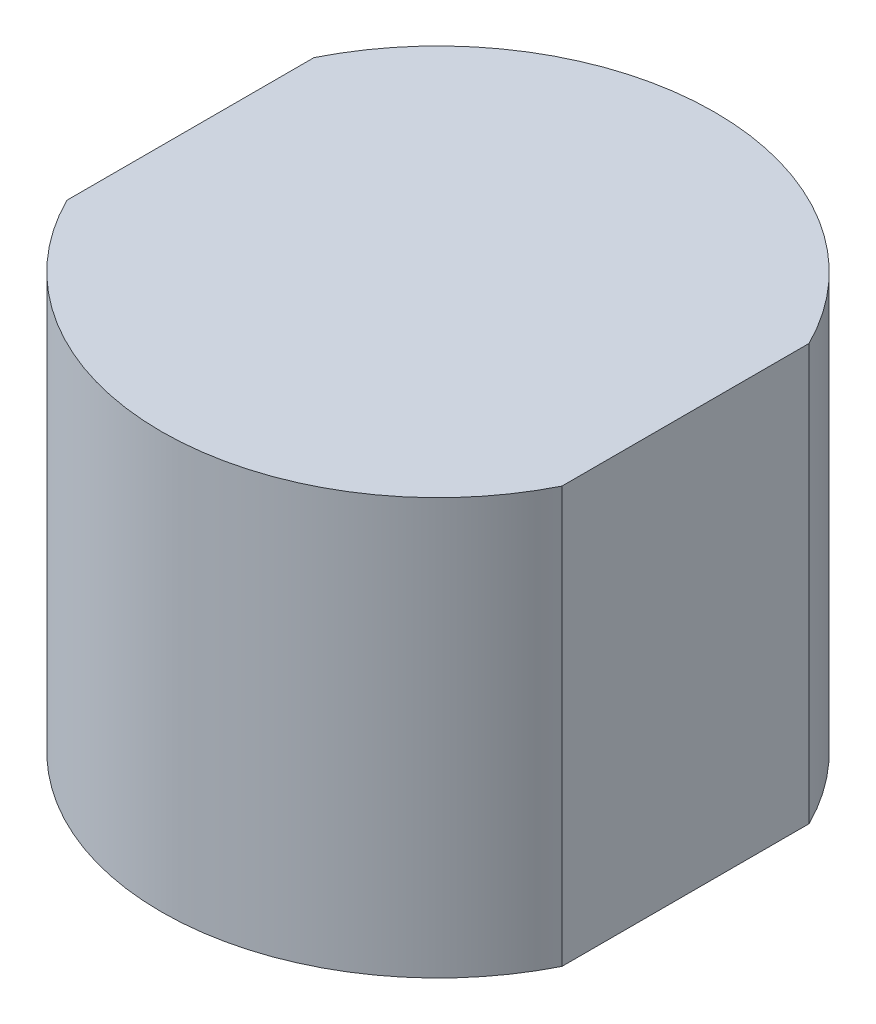
ISO-10303-21;
HEADER;
FILE_DESCRIPTION(('STEP AP214'),'2;1');
FILE_NAME('part.step','',(''),(''),'','','');
FILE_SCHEMA(('AUTOMOTIVE_DESIGN { 1 0 10303 214 1 1 1 1 }'));
ENDSEC;
DATA;
#1=APPLICATION_CONTEXT('core data for automotive mechanical design processes');
#2=APPLICATION_PROTOCOL_DEFINITION('international standard','automotive_design',2000,#1);
#3=PRODUCT_CONTEXT('',#1,'mechanical');
#4=PRODUCT('Part','Part','',(#3));
#5=PRODUCT_RELATED_PRODUCT_CATEGORY('part','',(#4));
#6=PRODUCT_DEFINITION_FORMATION('','',#4);
#7=PRODUCT_DEFINITION_CONTEXT('part definition',#1,'design');
#8=PRODUCT_DEFINITION('design','',#6,#7);
#9=PRODUCT_DEFINITION_SHAPE('','',#8);
#10=(LENGTH_UNIT() NAMED_UNIT(*) SI_UNIT(.MILLI.,.METRE.));
#11=(NAMED_UNIT(*) PLANE_ANGLE_UNIT() SI_UNIT($,.RADIAN.));
#12=(NAMED_UNIT(*) SI_UNIT($,.STERADIAN.) SOLID_ANGLE_UNIT());
#13=UNCERTAINTY_MEASURE_WITH_UNIT(LENGTH_MEASURE(1.E-05),#10,'distance_accuracy_value','');
#14=(GEOMETRIC_REPRESENTATION_CONTEXT(3) GLOBAL_UNCERTAINTY_ASSIGNED_CONTEXT((#13)) GLOBAL_UNIT_ASSIGNED_CONTEXT((#10,
#11,#12)) REPRESENTATION_CONTEXT('',''));
#15=CARTESIAN_POINT('',(0.,0.,0.));
#16=DIRECTION('',(0.,0.,1.));
#17=DIRECTION('',(1.,0.,0.));
#18=AXIS2_PLACEMENT_3D('',#15,#16,#17);
#19=CARTESIAN_POINT('',(5.94992436926723,10.,0.));
#20=DIRECTION('',(-1.,0.,0.));
#21=DIRECTION('',(0.,0.,1.));
#22=AXIS2_PLACEMENT_3D('',#19,#20,#21);
#23=PLANE('',#22);
#24=DIRECTION('',(0.,0.,-1.));
#25=VECTOR('',#24,1.);
#26=CARTESIAN_POINT('',(5.94992436926723,0.,0.));
#27=LINE('',#26,#25);
#28=CARTESIAN_POINT('',(5.94992436926723,0.,2.97));
#29=VERTEX_POINT('',#28);
#30=CARTESIAN_POINT('',(5.94992436926723,0.,-2.97));
#31=VERTEX_POINT('',#30);
#32=EDGE_CURVE('E107',#29,#31,#27,.T.);
#33=ORIENTED_EDGE('',*,*,#32,.T.);
#34=DIRECTION('',(0.,-1.,0.));
#35=VECTOR('',#34,1.);
#36=CARTESIAN_POINT('',(5.94992436926723,10.,-2.97));
#37=LINE('',#36,#35);
#38=CARTESIAN_POINT('',(5.94992436926723,10.,-2.97));
#39=VERTEX_POINT('',#38);
#40=EDGE_CURVE('E11',#39,#31,#37,.T.);
#41=ORIENTED_EDGE('',*,*,#40,.F.);
#42=DIRECTION('',(0.,0.,-1.));
#43=VECTOR('',#42,1.);
#44=CARTESIAN_POINT('',(5.94992436926723,10.,0.));
#45=LINE('',#44,#43);
#46=CARTESIAN_POINT('',(5.94992436926723,10.,2.97));
#47=VERTEX_POINT('',#46);
#48=EDGE_CURVE('E89',#47,#39,#45,.T.);
#49=ORIENTED_EDGE('',*,*,#48,.F.);
#50=DIRECTION('',(0.,-1.,0.));
#51=VECTOR('',#50,1.);
#52=CARTESIAN_POINT('',(5.94992436926723,10.,2.97));
#53=LINE('',#52,#51);
#54=EDGE_CURVE('E104',#47,#29,#53,.T.);
#55=ORIENTED_EDGE('',*,*,#54,.T.);
#56=EDGE_LOOP('',(#33,#41,#49,#55));
#57=FACE_BOUND('',#56,.T.);
#58=ADVANCED_FACE('F41',(#57),#23,.F.);
#59=CARTESIAN_POINT('',(0.,10.,0.));
#60=DIRECTION('',(0.,-1.,0.));
#61=DIRECTION('',(0.,0.,-1.));
#62=AXIS2_PLACEMENT_3D('',#59,#60,#61);
#63=CYLINDRICAL_SURFACE('',#62,6.65);
#64=CARTESIAN_POINT('',(0.,0.,0.));
#65=DIRECTION('',(0.,1.,0.));
#66=DIRECTION('',(0.,0.,1.));
#67=AXIS2_PLACEMENT_3D('',#64,#65,#66);
#68=CIRCLE('',#67,6.65);
#69=CARTESIAN_POINT('',(-5.94992436926723,0.,-2.97));
#70=VERTEX_POINT('',#69);
#71=EDGE_CURVE('E95',#31,#70,#68,.T.);
#72=ORIENTED_EDGE('',*,*,#71,.T.);
#73=DIRECTION('',(0.,-1.,0.));
#74=VECTOR('',#73,1.);
#75=CARTESIAN_POINT('',(-5.94992436926723,10.,-2.97));
#76=LINE('',#75,#74);
#77=CARTESIAN_POINT('',(-5.94992436926723,10.,-2.97));
#78=VERTEX_POINT('',#77);
#79=EDGE_CURVE('E50',#78,#70,#76,.T.);
#80=ORIENTED_EDGE('',*,*,#79,.F.);
#81=CARTESIAN_POINT('',(0.,10.,0.));
#82=DIRECTION('',(0.,1.,0.));
#83=DIRECTION('',(0.,0.,1.));
#84=AXIS2_PLACEMENT_3D('',#81,#82,#83);
#85=CIRCLE('',#84,6.65);
#86=EDGE_CURVE('E84',#39,#78,#85,.T.);
#87=ORIENTED_EDGE('',*,*,#86,.F.);
#88=ORIENTED_EDGE('',*,*,#40,.T.);
#89=EDGE_LOOP('',(#72,#80,#87,#88));
#90=FACE_BOUND('',#89,.T.);
#91=ADVANCED_FACE('F94',(#90),#63,.T.);
#92=CARTESIAN_POINT('',(-5.94992436926723,10.,0.));
#93=DIRECTION('',(-1.,0.,0.));
#94=DIRECTION('',(0.,0.,1.));
#95=AXIS2_PLACEMENT_3D('',#92,#93,#94);
#96=PLANE('',#95);
#97=DIRECTION('',(0.,0.,-1.));
#98=VECTOR('',#97,1.);
#99=CARTESIAN_POINT('',(-5.94992436926723,0.,0.));
#100=LINE('',#99,#98);
#101=CARTESIAN_POINT('',(-5.94992436926723,0.,2.97));
#102=VERTEX_POINT('',#101);
#103=EDGE_CURVE('E113',#102,#70,#100,.T.);
#104=ORIENTED_EDGE('',*,*,#103,.F.);
#105=DIRECTION('',(0.,-1.,0.));
#106=VECTOR('',#105,1.);
#107=CARTESIAN_POINT('',(-5.94992436926723,10.,2.97));
#108=LINE('',#107,#106);
#109=CARTESIAN_POINT('',(-5.94992436926723,10.,2.97));
#110=VERTEX_POINT('',#109);
#111=EDGE_CURVE('E74',#110,#102,#108,.T.);
#112=ORIENTED_EDGE('',*,*,#111,.F.);
#113=DIRECTION('',(0.,0.,-1.));
#114=VECTOR('',#113,1.);
#115=CARTESIAN_POINT('',(-5.94992436926723,10.,0.));
#116=LINE('',#115,#114);
#117=EDGE_CURVE('E87',#110,#78,#116,.T.);
#118=ORIENTED_EDGE('',*,*,#117,.T.);
#119=ORIENTED_EDGE('',*,*,#79,.T.);
#120=EDGE_LOOP('',(#104,#112,#118,#119));
#121=FACE_BOUND('',#120,.T.);
#122=ADVANCED_FACE('F100',(#121),#96,.T.);
#123=EDGE_CURVE('E77',#102,#29,#68,.T.);
#124=ORIENTED_EDGE('',*,*,#123,.T.);
#125=ORIENTED_EDGE('',*,*,#54,.F.);
#126=EDGE_CURVE('E58',#110,#47,#85,.T.);
#127=ORIENTED_EDGE('',*,*,#126,.F.);
#128=ORIENTED_EDGE('',*,*,#111,.T.);
#129=EDGE_LOOP('',(#124,#125,#127,#128));
#130=FACE_BOUND('',#129,.T.);
#131=ADVANCED_FACE('F130',(#130),#63,.T.);
#132=CARTESIAN_POINT('',(0.,10.,0.));
#133=DIRECTION('',(0.,1.,0.));
#134=DIRECTION('',(0.,0.,1.));
#135=AXIS2_PLACEMENT_3D('',#132,#133,#134);
#136=PLANE('',#135);
#137=ORIENTED_EDGE('',*,*,#48,.T.);
#138=ORIENTED_EDGE('',*,*,#86,.T.);
#139=ORIENTED_EDGE('',*,*,#117,.F.);
#140=ORIENTED_EDGE('',*,*,#126,.T.);
#141=EDGE_LOOP('',(#137,#138,#139,#140));
#142=FACE_BOUND('',#141,.T.);
#143=ADVANCED_FACE('F85',(#142),#136,.T.);
#144=CARTESIAN_POINT('',(0.,0.,0.));
#145=DIRECTION('',(0.,1.,0.));
#146=DIRECTION('',(0.,0.,1.));
#147=AXIS2_PLACEMENT_3D('',#144,#145,#146);
#148=PLANE('',#147);
#149=ORIENTED_EDGE('',*,*,#32,.F.);
#150=ORIENTED_EDGE('',*,*,#123,.F.);
#151=ORIENTED_EDGE('',*,*,#103,.T.);
#152=ORIENTED_EDGE('',*,*,#71,.F.);
#153=EDGE_LOOP('',(#149,#150,#151,#152));
#154=FACE_BOUND('',#153,.T.);
#155=ADVANCED_FACE('F122',(#154),#148,.F.);
#156=CLOSED_SHELL('',(#58,#91,#122,#131,#143,#155));
#157=MANIFOLD_SOLID_BREP('B2',#156);
#158=ADVANCED_BREP_SHAPE_REPRESENTATION('',(#18,#157),#14);
#159=SHAPE_DEFINITION_REPRESENTATION(#9,#158);
ENDSEC;
END-ISO-10303-21;
